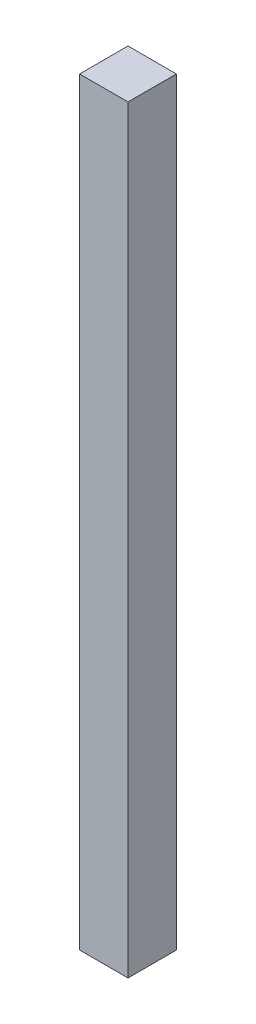
ISO-10303-21;
HEADER;
FILE_DESCRIPTION(('STEP AP214'),'2;1');
FILE_NAME('part.step','',(''),(''),'','','');
FILE_SCHEMA(('AUTOMOTIVE_DESIGN { 1 0 10303 214 1 1 1 1 }'));
ENDSEC;
DATA;
#1=APPLICATION_CONTEXT('core data for automotive mechanical design processes');
#2=APPLICATION_PROTOCOL_DEFINITION('international standard','automotive_design',2000,#1);
#3=PRODUCT_CONTEXT('',#1,'mechanical');
#4=PRODUCT('Part','Part','',(#3));
#5=PRODUCT_RELATED_PRODUCT_CATEGORY('part','',(#4));
#6=PRODUCT_DEFINITION_FORMATION('','',#4);
#7=PRODUCT_DEFINITION_CONTEXT('part definition',#1,'design');
#8=PRODUCT_DEFINITION('design','',#6,#7);
#9=PRODUCT_DEFINITION_SHAPE('','',#8);
#10=(LENGTH_UNIT() NAMED_UNIT(*) SI_UNIT(.MILLI.,.METRE.));
#11=(NAMED_UNIT(*) PLANE_ANGLE_UNIT() SI_UNIT($,.RADIAN.));
#12=(NAMED_UNIT(*) SI_UNIT($,.STERADIAN.) SOLID_ANGLE_UNIT());
#13=UNCERTAINTY_MEASURE_WITH_UNIT(LENGTH_MEASURE(1.E-05),#10,'distance_accuracy_value','');
#14=(GEOMETRIC_REPRESENTATION_CONTEXT(3) GLOBAL_UNCERTAINTY_ASSIGNED_CONTEXT((#13)) GLOBAL_UNIT_ASSIGNED_CONTEXT((#10,
#11,#12)) REPRESENTATION_CONTEXT('',''));
#15=CARTESIAN_POINT('',(0.,0.,0.));
#16=DIRECTION('',(0.,0.,1.));
#17=DIRECTION('',(1.,0.,0.));
#18=AXIS2_PLACEMENT_3D('',#15,#16,#17);
#19=CARTESIAN_POINT('',(685.8,-38.1000000000001,38.1));
#20=DIRECTION('',(0.,-1.,0.));
#21=DIRECTION('',(1.,0.,0.));
#22=AXIS2_PLACEMENT_3D('',#19,#20,#21);
#23=PLANE('',#22);
#24=DIRECTION('',(-1.,0.,0.));
#25=VECTOR('',#24,1.);
#26=CARTESIAN_POINT('',(685.8,-38.1000000000001,0.));
#27=LINE('',#26,#25);
#28=CARTESIAN_POINT('',(685.8,-38.1000000000001,0.));
#29=VERTEX_POINT('',#28);
#30=CARTESIAN_POINT('',(647.7,-38.1000000000001,0.));
#31=VERTEX_POINT('',#30);
#32=EDGE_CURVE('E96',#29,#31,#27,.T.);
#33=ORIENTED_EDGE('',*,*,#32,.T.);
#34=DIRECTION('',(0.,0.,-1.));
#35=VECTOR('',#34,1.);
#36=CARTESIAN_POINT('',(647.7,-38.1000000000001,38.1));
#37=LINE('',#36,#35);
#38=CARTESIAN_POINT('',(647.7,-38.1000000000001,38.1));
#39=VERTEX_POINT('',#38);
#40=EDGE_CURVE('E11',#39,#31,#37,.T.);
#41=ORIENTED_EDGE('',*,*,#40,.F.);
#42=DIRECTION('',(-1.,0.,0.));
#43=VECTOR('',#42,1.);
#44=CARTESIAN_POINT('',(685.8,-38.1000000000001,38.1));
#45=LINE('',#44,#43);
#46=CARTESIAN_POINT('',(685.8,-38.1000000000001,38.1));
#47=VERTEX_POINT('',#46);
#48=EDGE_CURVE('E82',#47,#39,#45,.T.);
#49=ORIENTED_EDGE('',*,*,#48,.F.);
#50=DIRECTION('',(0.,0.,-1.));
#51=VECTOR('',#50,1.);
#52=CARTESIAN_POINT('',(685.8,-38.1000000000001,38.1));
#53=LINE('',#52,#51);
#54=EDGE_CURVE('E49',#47,#29,#53,.T.);
#55=ORIENTED_EDGE('',*,*,#54,.T.);
#56=EDGE_LOOP('',(#33,#41,#49,#55));
#57=FACE_BOUND('',#56,.T.);
#58=ADVANCED_FACE('F33',(#57),#23,.F.);
#59=CARTESIAN_POINT('',(647.7,-38.1000000000001,38.1));
#60=DIRECTION('',(1.,0.,0.));
#61=DIRECTION('',(0.,1.,0.));
#62=AXIS2_PLACEMENT_3D('',#59,#60,#61);
#63=PLANE('',#62);
#64=DIRECTION('',(0.,-1.,0.));
#65=VECTOR('',#64,1.);
#66=CARTESIAN_POINT('',(647.7,-38.1000000000001,0.));
#67=LINE('',#66,#65);
#68=CARTESIAN_POINT('',(647.7,-635.,0.));
#69=VERTEX_POINT('',#68);
#70=EDGE_CURVE('E87',#31,#69,#67,.T.);
#71=ORIENTED_EDGE('',*,*,#70,.T.);
#72=DIRECTION('',(0.,0.,-1.));
#73=VECTOR('',#72,1.);
#74=CARTESIAN_POINT('',(647.7,-635.,38.1));
#75=LINE('',#74,#73);
#76=CARTESIAN_POINT('',(647.7,-635.,38.1));
#77=VERTEX_POINT('',#76);
#78=EDGE_CURVE('E41',#77,#69,#75,.T.);
#79=ORIENTED_EDGE('',*,*,#78,.F.);
#80=DIRECTION('',(0.,-1.,0.));
#81=VECTOR('',#80,1.);
#82=CARTESIAN_POINT('',(647.7,-38.1000000000001,38.1));
#83=LINE('',#82,#81);
#84=EDGE_CURVE('E74',#39,#77,#83,.T.);
#85=ORIENTED_EDGE('',*,*,#84,.F.);
#86=ORIENTED_EDGE('',*,*,#40,.T.);
#87=EDGE_LOOP('',(#71,#79,#85,#86));
#88=FACE_BOUND('',#87,.T.);
#89=ADVANCED_FACE('F86',(#88),#63,.F.);
#90=CARTESIAN_POINT('',(685.8,-635.,38.1));
#91=DIRECTION('',(0.,-1.,0.));
#92=DIRECTION('',(0.,0.,-1.));
#93=AXIS2_PLACEMENT_3D('',#90,#91,#92);
#94=PLANE('',#93);
#95=DIRECTION('',(-1.,0.,0.));
#96=VECTOR('',#95,1.);
#97=CARTESIAN_POINT('',(685.8,-635.,0.));
#98=LINE('',#97,#96);
#99=CARTESIAN_POINT('',(685.8,-635.,0.));
#100=VERTEX_POINT('',#99);
#101=EDGE_CURVE('E99',#100,#69,#98,.T.);
#102=ORIENTED_EDGE('',*,*,#101,.F.);
#103=DIRECTION('',(0.,0.,-1.));
#104=VECTOR('',#103,1.);
#105=CARTESIAN_POINT('',(685.8,-635.,38.1));
#106=LINE('',#105,#104);
#107=CARTESIAN_POINT('',(685.8,-635.,38.1));
#108=VERTEX_POINT('',#107);
#109=EDGE_CURVE('E63',#108,#100,#106,.T.);
#110=ORIENTED_EDGE('',*,*,#109,.F.);
#111=DIRECTION('',(-1.,0.,0.));
#112=VECTOR('',#111,1.);
#113=CARTESIAN_POINT('',(685.8,-635.,38.1));
#114=LINE('',#113,#112);
#115=EDGE_CURVE('E81',#108,#77,#114,.T.);
#116=ORIENTED_EDGE('',*,*,#115,.T.);
#117=ORIENTED_EDGE('',*,*,#78,.T.);
#118=EDGE_LOOP('',(#102,#110,#116,#117));
#119=FACE_BOUND('',#118,.T.);
#120=ADVANCED_FACE('F90',(#119),#94,.T.);
#121=CARTESIAN_POINT('',(685.8,-38.1000000000001,38.1));
#122=DIRECTION('',(1.,0.,0.));
#123=DIRECTION('',(0.,0.,-1.));
#124=AXIS2_PLACEMENT_3D('',#121,#122,#123);
#125=PLANE('',#124);
#126=DIRECTION('',(0.,-1.,0.));
#127=VECTOR('',#126,1.);
#128=CARTESIAN_POINT('',(685.8,-38.1000000000001,0.));
#129=LINE('',#128,#127);
#130=EDGE_CURVE('E101',#29,#100,#129,.T.);
#131=ORIENTED_EDGE('',*,*,#130,.F.);
#132=ORIENTED_EDGE('',*,*,#54,.F.);
#133=DIRECTION('',(0.,-1.,0.));
#134=VECTOR('',#133,1.);
#135=CARTESIAN_POINT('',(685.8,-38.1000000000001,38.1));
#136=LINE('',#135,#134);
#137=EDGE_CURVE('E91',#47,#108,#136,.T.);
#138=ORIENTED_EDGE('',*,*,#137,.T.);
#139=ORIENTED_EDGE('',*,*,#109,.T.);
#140=EDGE_LOOP('',(#131,#132,#138,#139));
#141=FACE_BOUND('',#140,.T.);
#142=ADVANCED_FACE('F107',(#141),#125,.T.);
#143=CARTESIAN_POINT('',(0.,0.,38.1));
#144=DIRECTION('',(0.,0.,1.));
#145=DIRECTION('',(1.,0.,0.));
#146=AXIS2_PLACEMENT_3D('',#143,#144,#145);
#147=PLANE('',#146);
#148=ORIENTED_EDGE('',*,*,#48,.T.);
#149=ORIENTED_EDGE('',*,*,#84,.T.);
#150=ORIENTED_EDGE('',*,*,#115,.F.);
#151=ORIENTED_EDGE('',*,*,#137,.F.);
#152=EDGE_LOOP('',(#148,#149,#150,#151));
#153=FACE_BOUND('',#152,.T.);
#154=ADVANCED_FACE('F78',(#153),#147,.T.);
#155=CARTESIAN_POINT('',(0.,0.,0.));
#156=DIRECTION('',(0.,0.,1.));
#157=DIRECTION('',(1.,0.,0.));
#158=AXIS2_PLACEMENT_3D('',#155,#156,#157);
#159=PLANE('',#158);
#160=ORIENTED_EDGE('',*,*,#32,.F.);
#161=ORIENTED_EDGE('',*,*,#130,.T.);
#162=ORIENTED_EDGE('',*,*,#101,.T.);
#163=ORIENTED_EDGE('',*,*,#70,.F.);
#164=EDGE_LOOP('',(#160,#161,#162,#163));
#165=FACE_BOUND('',#164,.T.);
#166=ADVANCED_FACE('F106',(#165),#159,.F.);
#167=CLOSED_SHELL('',(#58,#89,#120,#142,#154,#166));
#168=MANIFOLD_SOLID_BREP('B2',#167);
#169=ADVANCED_BREP_SHAPE_REPRESENTATION('',(#18,#168),#14);
#170=SHAPE_DEFINITION_REPRESENTATION(#9,#169);
ENDSEC;
END-ISO-10303-21;
